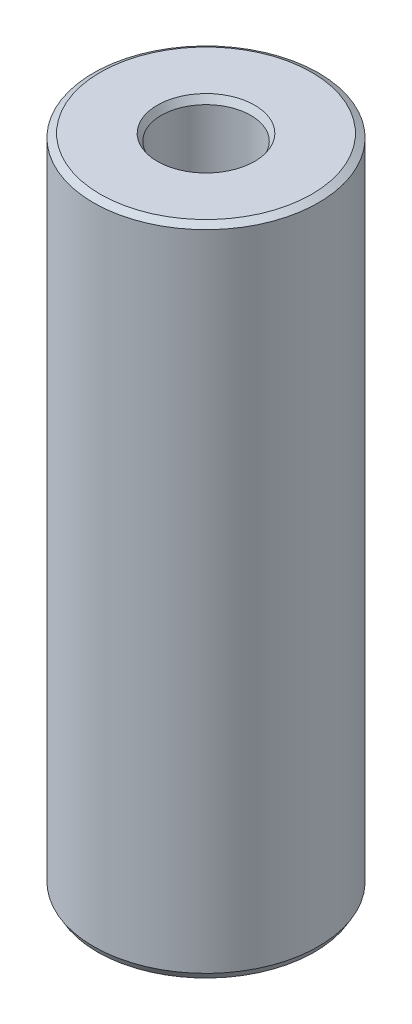
ISO-10303-21;
HEADER;
FILE_DESCRIPTION(('STEP AP214'),'2;1');
FILE_NAME('part.step','',(''),(''),'','','');
FILE_SCHEMA(('AUTOMOTIVE_DESIGN { 1 0 10303 214 1 1 1 1 }'));
ENDSEC;
DATA;
#1=APPLICATION_CONTEXT('core data for automotive mechanical design processes');
#2=APPLICATION_PROTOCOL_DEFINITION('international standard','automotive_design',2000,#1);
#3=PRODUCT_CONTEXT('',#1,'mechanical');
#4=PRODUCT('Part','Part','',(#3));
#5=PRODUCT_RELATED_PRODUCT_CATEGORY('part','',(#4));
#6=PRODUCT_DEFINITION_FORMATION('','',#4);
#7=PRODUCT_DEFINITION_CONTEXT('part definition',#1,'design');
#8=PRODUCT_DEFINITION('design','',#6,#7);
#9=PRODUCT_DEFINITION_SHAPE('','',#8);
#10=(LENGTH_UNIT() NAMED_UNIT(*) SI_UNIT(.MILLI.,.METRE.));
#11=(NAMED_UNIT(*) PLANE_ANGLE_UNIT() SI_UNIT($,.RADIAN.));
#12=(NAMED_UNIT(*) SI_UNIT($,.STERADIAN.) SOLID_ANGLE_UNIT());
#13=UNCERTAINTY_MEASURE_WITH_UNIT(LENGTH_MEASURE(1.E-05),#10,'distance_accuracy_value','');
#14=(GEOMETRIC_REPRESENTATION_CONTEXT(3) GLOBAL_UNCERTAINTY_ASSIGNED_CONTEXT((#13)) GLOBAL_UNIT_ASSIGNED_CONTEXT((#10,
#11,#12)) REPRESENTATION_CONTEXT('',''));
#15=CARTESIAN_POINT('',(0.,0.,0.));
#16=DIRECTION('',(0.,0.,1.));
#17=DIRECTION('',(1.,0.,0.));
#18=AXIS2_PLACEMENT_3D('',#15,#16,#17);
#19=CARTESIAN_POINT('',(0.,276.476043292922,0.));
#20=DIRECTION('',(0.,-1.,0.));
#21=DIRECTION('',(0.,0.,-1.));
#22=AXIS2_PLACEMENT_3D('',#19,#20,#21);
#23=CYLINDRICAL_SURFACE('',#22,47.5);
#24=CARTESIAN_POINT('',(0.,2.87975146817865,0.));
#25=DIRECTION('',(0.,1.,0.));
#26=DIRECTION('',(0.,0.,1.));
#27=AXIS2_PLACEMENT_3D('',#24,#25,#26);
#28=CIRCLE('',#27,47.5);
#29=CARTESIAN_POINT('',(0.,2.87975146817865,47.5));
#30=VERTEX_POINT('',#29);
#31=EDGE_CURVE('E10',#30,#30,#28,.T.);
#32=ORIENTED_EDGE('',*,*,#31,.T.);
#33=EDGE_LOOP('',(#32));
#34=FACE_BOUND('',#33,.T.);
#35=CARTESIAN_POINT('',(0.,274.81341800757,0.));
#36=DIRECTION('',(0.,1.,0.));
#37=DIRECTION('',(0.,0.,1.));
#38=AXIS2_PLACEMENT_3D('',#35,#36,#37);
#39=CIRCLE('',#38,47.5);
#40=CARTESIAN_POINT('',(0.,274.81341800757,47.5));
#41=VERTEX_POINT('',#40);
#42=EDGE_CURVE('E50',#41,#41,#39,.F.);
#43=ORIENTED_EDGE('',*,*,#42,.T.);
#44=EDGE_LOOP('',(#43));
#45=FACE_BOUND('',#44,.T.);
#46=ADVANCED_FACE('F39',(#34,#45),#23,.T.);
#47=CARTESIAN_POINT('',(0.,276.476043292922,0.));
#48=DIRECTION('',(0.,1.,0.));
#49=DIRECTION('',(0.,0.,1.));
#50=AXIS2_PLACEMENT_3D('',#47,#48,#49);
#51=PLANE('',#50);
#52=CARTESIAN_POINT('',(0.,276.476043292922,0.));
#53=DIRECTION('',(0.,1.,0.));
#54=DIRECTION('',(0.,0.,1.));
#55=AXIS2_PLACEMENT_3D('',#52,#53,#54);
#56=CIRCLE('',#55,20.5624019182971);
#57=CARTESIAN_POINT('',(0.,276.476043292922,20.5624019182971));
#58=VERTEX_POINT('',#57);
#59=EDGE_CURVE('E58',#58,#58,#56,.F.);
#60=ORIENTED_EDGE('',*,*,#59,.T.);
#61=EDGE_LOOP('',(#60));
#62=FACE_BOUND('',#61,.T.);
#63=CARTESIAN_POINT('',(0.,276.476043292922,0.));
#64=DIRECTION('',(0.,1.,0.));
#65=DIRECTION('',(0.,0.,1.));
#66=AXIS2_PLACEMENT_3D('',#63,#64,#65);
#67=CIRCLE('',#66,44.6202485318214);
#68=CARTESIAN_POINT('',(0.,276.476043292922,44.6202485318214));
#69=VERTEX_POINT('',#68);
#70=EDGE_CURVE('E61',#69,#69,#67,.T.);
#71=ORIENTED_EDGE('',*,*,#70,.T.);
#72=EDGE_LOOP('',(#71));
#73=FACE_BOUND('',#72,.T.);
#74=ADVANCED_FACE('F88',(#62,#73),#51,.T.);
#75=CARTESIAN_POINT('',(0.,0.,0.));
#76=DIRECTION('',(0.,1.,0.));
#77=DIRECTION('',(0.,0.,1.));
#78=AXIS2_PLACEMENT_3D('',#75,#76,#77);
#79=PLANE('',#78);
#80=CARTESIAN_POINT('',(0.,0.,0.));
#81=DIRECTION('',(0.,1.,0.));
#82=DIRECTION('',(0.,0.,1.));
#83=AXIS2_PLACEMENT_3D('',#80,#81,#82);
#84=CIRCLE('',#83,21.7795281011235);
#85=CARTESIAN_POINT('',(0.,0.,21.7795281011235));
#86=VERTEX_POINT('',#85);
#87=EDGE_CURVE('E51',#86,#86,#84,.T.);
#88=ORIENTED_EDGE('',*,*,#87,.T.);
#89=EDGE_LOOP('',(#88));
#90=FACE_BOUND('',#89,.T.);
#91=CARTESIAN_POINT('',(0.,0.,0.));
#92=DIRECTION('',(0.,1.,0.));
#93=DIRECTION('',(0.,0.,1.));
#94=AXIS2_PLACEMENT_3D('',#91,#92,#93);
#95=CIRCLE('',#94,45.8373747146478);
#96=CARTESIAN_POINT('',(0.,0.,45.8373747146478));
#97=VERTEX_POINT('',#96);
#98=EDGE_CURVE('E54',#97,#97,#95,.F.);
#99=ORIENTED_EDGE('',*,*,#98,.T.);
#100=EDGE_LOOP('',(#99));
#101=FACE_BOUND('',#100,.T.);
#102=ADVANCED_FACE('F83',(#90,#101),#79,.F.);
#103=CARTESIAN_POINT('',(0.,276.476043292922,0.));
#104=DIRECTION('',(0.,-1.,0.));
#105=DIRECTION('',(0.,0.,-1.));
#106=AXIS2_PLACEMENT_3D('',#103,#104,#105);
#107=CYLINDRICAL_SURFACE('',#106,18.899776632945);
#108=CARTESIAN_POINT('',(0.,273.596291824743,0.));
#109=DIRECTION('',(0.,1.,0.));
#110=DIRECTION('',(0.,0.,1.));
#111=AXIS2_PLACEMENT_3D('',#108,#109,#110);
#112=CIRCLE('',#111,18.899776632945);
#113=CARTESIAN_POINT('',(0.,273.596291824743,18.899776632945));
#114=VERTEX_POINT('',#113);
#115=EDGE_CURVE('E67',#114,#114,#112,.T.);
#116=ORIENTED_EDGE('',*,*,#115,.T.);
#117=EDGE_LOOP('',(#116));
#118=FACE_BOUND('',#117,.T.);
#119=CARTESIAN_POINT('',(0.,1.6626252853521,0.));
#120=DIRECTION('',(0.,1.,0.));
#121=DIRECTION('',(0.,0.,1.));
#122=AXIS2_PLACEMENT_3D('',#119,#120,#121);
#123=CIRCLE('',#122,18.899776632945);
#124=CARTESIAN_POINT('',(0.,1.6626252853521,18.899776632945));
#125=VERTEX_POINT('',#124);
#126=EDGE_CURVE('E69',#125,#125,#123,.F.);
#127=ORIENTED_EDGE('',*,*,#126,.T.);
#128=EDGE_LOOP('',(#127));
#129=FACE_BOUND('',#128,.T.);
#130=ADVANCED_FACE('F71',(#118,#129),#107,.F.);
#131=CARTESIAN_POINT('',(0.,273.596291824743,0.));
#132=DIRECTION('',(0.,1.,0.));
#133=DIRECTION('',(0.,0.,1.));
#134=AXIS2_PLACEMENT_3D('',#131,#132,#133);
#135=CONICAL_SURFACE('',#134,18.899776632945,0.523598775598301);
#136=ORIENTED_EDGE('',*,*,#59,.F.);
#137=EDGE_LOOP('',(#136));
#138=FACE_BOUND('',#137,.T.);
#139=ORIENTED_EDGE('',*,*,#115,.F.);
#140=EDGE_LOOP('',(#139));
#141=FACE_BOUND('',#140,.T.);
#142=ADVANCED_FACE('F77',(#138,#141),#135,.F.);
#143=CARTESIAN_POINT('',(0.,0.,0.));
#144=DIRECTION('',(0.,-1.,0.));
#145=DIRECTION('',(0.,0.,-1.));
#146=AXIS2_PLACEMENT_3D('',#143,#144,#145);
#147=CONICAL_SURFACE('',#146,21.7795281011235,1.0471975511966);
#148=ORIENTED_EDGE('',*,*,#126,.F.);
#149=EDGE_LOOP('',(#148));
#150=FACE_BOUND('',#149,.T.);
#151=ORIENTED_EDGE('',*,*,#87,.F.);
#152=EDGE_LOOP('',(#151));
#153=FACE_BOUND('',#152,.T.);
#154=ADVANCED_FACE('F73',(#150,#153),#147,.F.);
#155=CARTESIAN_POINT('',(0.,2.87975146817865,0.));
#156=DIRECTION('',(0.,1.,0.));
#157=DIRECTION('',(0.,0.,1.));
#158=AXIS2_PLACEMENT_3D('',#155,#156,#157);
#159=CONICAL_SURFACE('',#158,47.5,0.5235987755983);
#160=ORIENTED_EDGE('',*,*,#98,.F.);
#161=EDGE_LOOP('',(#160));
#162=FACE_BOUND('',#161,.T.);
#163=ORIENTED_EDGE('',*,*,#31,.F.);
#164=EDGE_LOOP('',(#163));
#165=FACE_BOUND('',#164,.T.);
#166=ADVANCED_FACE('F76',(#162,#165),#159,.T.);
#167=CARTESIAN_POINT('',(0.,276.476043292922,0.));
#168=DIRECTION('',(0.,-1.,0.));
#169=DIRECTION('',(0.,0.,-1.));
#170=AXIS2_PLACEMENT_3D('',#167,#168,#169);
#171=CONICAL_SURFACE('',#170,44.6202485318214,1.04719755119658);
#172=ORIENTED_EDGE('',*,*,#42,.F.);
#173=EDGE_LOOP('',(#172));
#174=FACE_BOUND('',#173,.T.);
#175=ORIENTED_EDGE('',*,*,#70,.F.);
#176=EDGE_LOOP('',(#175));
#177=FACE_BOUND('',#176,.T.);
#178=ADVANCED_FACE('F45',(#174,#177),#171,.T.);
#179=CLOSED_SHELL('',(#46,#74,#102,#130,#142,#154,#166,#178));
#180=MANIFOLD_SOLID_BREP('B2',#179);
#181=ADVANCED_BREP_SHAPE_REPRESENTATION('',(#18,#180),#14);
#182=SHAPE_DEFINITION_REPRESENTATION(#9,#181);
ENDSEC;
END-ISO-10303-21;
